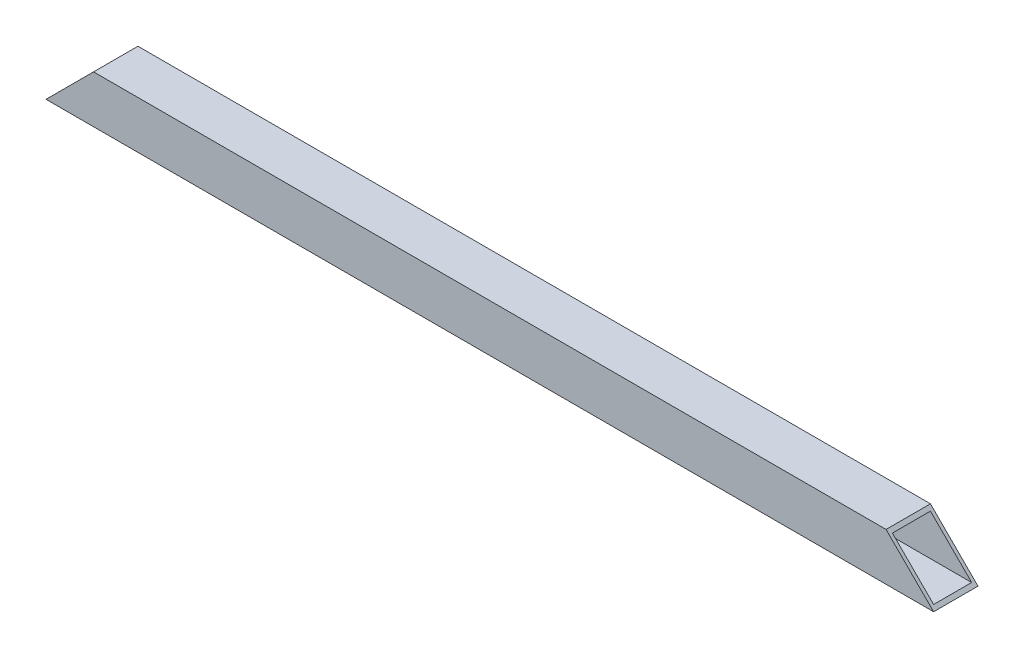
ISO-10303-21;
HEADER;
FILE_DESCRIPTION(('STEP AP214'),'2;1');
FILE_NAME('part.step','',(''),(''),'','','');
FILE_SCHEMA(('AUTOMOTIVE_DESIGN { 1 0 10303 214 1 1 1 1 }'));
ENDSEC;
DATA;
#1=APPLICATION_CONTEXT('core data for automotive mechanical design processes');
#2=APPLICATION_PROTOCOL_DEFINITION('international standard','automotive_design',2000,#1);
#3=PRODUCT_CONTEXT('',#1,'mechanical');
#4=PRODUCT('Part','Part','',(#3));
#5=PRODUCT_RELATED_PRODUCT_CATEGORY('part','',(#4));
#6=PRODUCT_DEFINITION_FORMATION('','',#4);
#7=PRODUCT_DEFINITION_CONTEXT('part definition',#1,'design');
#8=PRODUCT_DEFINITION('design','',#6,#7);
#9=PRODUCT_DEFINITION_SHAPE('','',#8);
#10=(LENGTH_UNIT() NAMED_UNIT(*) SI_UNIT(.MILLI.,.METRE.));
#11=(NAMED_UNIT(*) PLANE_ANGLE_UNIT() SI_UNIT($,.RADIAN.));
#12=(NAMED_UNIT(*) SI_UNIT($,.STERADIAN.) SOLID_ANGLE_UNIT());
#13=UNCERTAINTY_MEASURE_WITH_UNIT(LENGTH_MEASURE(1.E-05),#10,'distance_accuracy_value','');
#14=(GEOMETRIC_REPRESENTATION_CONTEXT(3) GLOBAL_UNCERTAINTY_ASSIGNED_CONTEXT((#13)) GLOBAL_UNIT_ASSIGNED_CONTEXT((#10,
#11,#12)) REPRESENTATION_CONTEXT('',''));
#15=CARTESIAN_POINT('',(0.,0.,0.));
#16=DIRECTION('',(0.,0.,1.));
#17=DIRECTION('',(1.,0.,0.));
#18=AXIS2_PLACEMENT_3D('',#15,#16,#17);
#19=CARTESIAN_POINT('',(1400.,-32.5,35.));
#20=DIRECTION('',(0.,1.,0.));
#21=DIRECTION('',(0.,0.,1.));
#22=AXIS2_PLACEMENT_3D('',#19,#20,#21);
#23=PLANE('',#22);
#24=DIRECTION('',(-1.,0.,0.));
#25=VECTOR('',#24,1.);
#26=CARTESIAN_POINT('',(1400.,-32.5,30.));
#27=LINE('',#26,#25);
#28=CARTESIAN_POINT('',(1395.,-32.5,30.));
#29=VERTEX_POINT('',#28);
#30=CARTESIAN_POINT('',(5.00000000000012,-32.5,30.));
#31=VERTEX_POINT('',#30);
#32=EDGE_CURVE('E160',#29,#31,#27,.T.);
#33=ORIENTED_EDGE('',*,*,#32,.F.);
#34=DIRECTION('',(0.,0.,-1.));
#35=VECTOR('',#34,1.);
#36=CARTESIAN_POINT('',(1395.,-32.5,35.));
#37=LINE('',#36,#35);
#38=CARTESIAN_POINT('',(1395.,-32.5,-30.));
#39=VERTEX_POINT('',#38);
#40=EDGE_CURVE('E13',#29,#39,#37,.T.);
#41=ORIENTED_EDGE('',*,*,#40,.T.);
#42=DIRECTION('',(-1.,0.,0.));
#43=VECTOR('',#42,1.);
#44=CARTESIAN_POINT('',(1400.,-32.5,-30.));
#45=LINE('',#44,#43);
#46=CARTESIAN_POINT('',(5.0000000000001,-32.5,-30.));
#47=VERTEX_POINT('',#46);
#48=EDGE_CURVE('E162',#39,#47,#45,.T.);
#49=ORIENTED_EDGE('',*,*,#48,.T.);
#50=DIRECTION('',(0.,0.,1.));
#51=VECTOR('',#50,1.);
#52=CARTESIAN_POINT('',(5.00000000000012,-32.5,35.0000000000004));
#53=LINE('',#52,#51);
#54=EDGE_CURVE('E67',#47,#31,#53,.T.);
#55=ORIENTED_EDGE('',*,*,#54,.T.);
#56=EDGE_LOOP('',(#33,#41,#49,#55));
#57=FACE_BOUND('',#56,.T.);
#58=ADVANCED_FACE('F59',(#57),#23,.T.);
#59=CARTESIAN_POINT('',(1400.,37.5,30.));
#60=DIRECTION('',(0.,0.,-1.));
#61=DIRECTION('',(0.,1.,0.));
#62=AXIS2_PLACEMENT_3D('',#59,#60,#61);
#63=PLANE('',#62);
#64=DIRECTION('',(-1.,0.,0.));
#65=VECTOR('',#64,1.);
#66=CARTESIAN_POINT('',(1400.,32.5,30.));
#67=LINE('',#66,#65);
#68=CARTESIAN_POINT('',(1330.,32.5,30.));
#69=VERTEX_POINT('',#68);
#70=CARTESIAN_POINT('',(69.9999999999998,32.5,30.));
#71=VERTEX_POINT('',#70);
#72=EDGE_CURVE('E170',#69,#71,#67,.T.);
#73=ORIENTED_EDGE('',*,*,#72,.F.);
#74=DIRECTION('',(0.707106781186546,-0.707106781186549,0.));
#75=VECTOR('',#74,1.);
#76=CARTESIAN_POINT('',(1362.5,3.53883589099269E-13,30.));
#77=LINE('',#76,#75);
#78=EDGE_CURVE('E169',#69,#29,#77,.T.);
#79=ORIENTED_EDGE('',*,*,#78,.T.);
#80=ORIENTED_EDGE('',*,*,#32,.T.);
#81=DIRECTION('',(0.707106781186546,0.707106781186549,0.));
#82=VECTOR('',#81,1.);
#83=CARTESIAN_POINT('',(737.499999999997,700.,30.0000000000001));
#84=LINE('',#83,#82);
#85=EDGE_CURVE('E81',#31,#71,#84,.T.);
#86=ORIENTED_EDGE('',*,*,#85,.T.);
#87=EDGE_LOOP('',(#73,#79,#80,#86));
#88=FACE_BOUND('',#87,.T.);
#89=ADVANCED_FACE('F167',(#88),#63,.T.);
#90=CARTESIAN_POINT('',(1400.,32.5,35.));
#91=DIRECTION('',(0.,-1.,0.));
#92=DIRECTION('',(0.,0.,-1.));
#93=AXIS2_PLACEMENT_3D('',#90,#91,#92);
#94=PLANE('',#93);
#95=DIRECTION('',(-1.,0.,0.));
#96=VECTOR('',#95,1.);
#97=CARTESIAN_POINT('',(1400.,32.5,-30.));
#98=LINE('',#97,#96);
#99=CARTESIAN_POINT('',(1330.,32.5,-30.));
#100=VERTEX_POINT('',#99);
#101=CARTESIAN_POINT('',(69.9999999999996,32.5,-30.));
#102=VERTEX_POINT('',#101);
#103=EDGE_CURVE('E134',#100,#102,#98,.T.);
#104=ORIENTED_EDGE('',*,*,#103,.F.);
#105=DIRECTION('',(0.,0.,1.));
#106=VECTOR('',#105,1.);
#107=CARTESIAN_POINT('',(1330.,32.5,35.));
#108=LINE('',#107,#106);
#109=EDGE_CURVE('E199',#100,#69,#108,.T.);
#110=ORIENTED_EDGE('',*,*,#109,.T.);
#111=ORIENTED_EDGE('',*,*,#72,.T.);
#112=DIRECTION('',(0.,0.,-1.));
#113=VECTOR('',#112,1.);
#114=CARTESIAN_POINT('',(69.9999999999996,32.5,35.0000000000004));
#115=LINE('',#114,#113);
#116=EDGE_CURVE('E193',#71,#102,#115,.T.);
#117=ORIENTED_EDGE('',*,*,#116,.T.);
#118=EDGE_LOOP('',(#104,#110,#111,#117));
#119=FACE_BOUND('',#118,.T.);
#120=ADVANCED_FACE('F205',(#119),#94,.T.);
#121=CARTESIAN_POINT('',(1400.,37.5,-30.));
#122=DIRECTION('',(0.,0.,1.));
#123=DIRECTION('',(0.,-1.,0.));
#124=AXIS2_PLACEMENT_3D('',#121,#122,#123);
#125=PLANE('',#124);
#126=ORIENTED_EDGE('',*,*,#48,.F.);
#127=DIRECTION('',(-0.707106781186546,0.707106781186549,0.));
#128=VECTOR('',#127,1.);
#129=CARTESIAN_POINT('',(1362.5,3.60822483003176E-13,-30.));
#130=LINE('',#129,#128);
#131=EDGE_CURVE('E74',#39,#100,#130,.T.);
#132=ORIENTED_EDGE('',*,*,#131,.T.);
#133=ORIENTED_EDGE('',*,*,#103,.T.);
#134=DIRECTION('',(-0.707106781186546,-0.707106781186549,0.));
#135=VECTOR('',#134,1.);
#136=CARTESIAN_POINT('',(737.499999999997,700.,-29.9999999999998));
#137=LINE('',#136,#135);
#138=EDGE_CURVE('E196',#102,#47,#137,.T.);
#139=ORIENTED_EDGE('',*,*,#138,.T.);
#140=EDGE_LOOP('',(#126,#132,#133,#139));
#141=FACE_BOUND('',#140,.T.);
#142=ADVANCED_FACE('F203',(#141),#125,.T.);
#143=CARTESIAN_POINT('',(74.9999999999997,37.5,35.));
#144=DIRECTION('',(-0.707106781186549,0.707106781186546,0.));
#145=DIRECTION('',(-0.707106781186546,-0.707106781186549,0.));
#146=AXIS2_PLACEMENT_3D('',#143,#144,#145);
#147=PLANE('',#146);
#148=ORIENTED_EDGE('',*,*,#116,.F.);
#149=ORIENTED_EDGE('',*,*,#85,.F.);
#150=ORIENTED_EDGE('',*,*,#54,.F.);
#151=ORIENTED_EDGE('',*,*,#138,.F.);
#152=EDGE_LOOP('',(#148,#149,#150,#151));
#153=FACE_BOUND('',#152,.T.);
#154=DIRECTION('',(0.707106781186546,0.707106781186549,0.));
#155=VECTOR('',#154,1.);
#156=CARTESIAN_POINT('',(74.9999999999997,37.5,-35.));
#157=LINE('',#156,#155);
#158=CARTESIAN_POINT('',(0.,-37.5,-35.));
#159=VERTEX_POINT('',#158);
#160=CARTESIAN_POINT('',(74.9999999999997,37.5,-35.));
#161=VERTEX_POINT('',#160);
#162=EDGE_CURVE('E128',#159,#161,#157,.T.);
#163=ORIENTED_EDGE('',*,*,#162,.F.);
#164=DIRECTION('',(0.,0.,-1.));
#165=VECTOR('',#164,1.);
#166=CARTESIAN_POINT('',(0.,-37.5,35.));
#167=LINE('',#166,#165);
#168=CARTESIAN_POINT('',(0.,-37.5,35.));
#169=VERTEX_POINT('',#168);
#170=EDGE_CURVE('E122',#169,#159,#167,.T.);
#171=ORIENTED_EDGE('',*,*,#170,.F.);
#172=DIRECTION('',(0.707106781186546,0.707106781186549,0.));
#173=VECTOR('',#172,1.);
#174=CARTESIAN_POINT('',(74.9999999999997,37.5,35.));
#175=LINE('',#174,#173);
#176=CARTESIAN_POINT('',(74.9999999999997,37.5,35.));
#177=VERTEX_POINT('',#176);
#178=EDGE_CURVE('E125',#169,#177,#175,.T.);
#179=ORIENTED_EDGE('',*,*,#178,.T.);
#180=DIRECTION('',(0.,0.,-1.));
#181=VECTOR('',#180,1.);
#182=CARTESIAN_POINT('',(74.9999999999997,37.5,35.));
#183=LINE('',#182,#181);
#184=EDGE_CURVE('E190',#177,#161,#183,.T.);
#185=ORIENTED_EDGE('',*,*,#184,.T.);
#186=EDGE_LOOP('',(#163,#171,#179,#185));
#187=FACE_BOUND('',#186,.T.);
#188=ADVANCED_FACE('F124',(#153,#187),#147,.T.);
#189=CARTESIAN_POINT('',(1400.,-37.5,35.));
#190=DIRECTION('',(0.707106781186549,0.707106781186546,0.));
#191=DIRECTION('',(-0.707106781186546,0.707106781186549,0.));
#192=AXIS2_PLACEMENT_3D('',#189,#190,#191);
#193=PLANE('',#192);
#194=ORIENTED_EDGE('',*,*,#40,.F.);
#195=ORIENTED_EDGE('',*,*,#78,.F.);
#196=ORIENTED_EDGE('',*,*,#109,.F.);
#197=ORIENTED_EDGE('',*,*,#131,.F.);
#198=EDGE_LOOP('',(#194,#195,#196,#197));
#199=FACE_BOUND('',#198,.T.);
#200=DIRECTION('',(0.707106781186546,-0.707106781186549,0.));
#201=VECTOR('',#200,1.);
#202=CARTESIAN_POINT('',(1400.,-37.5,-35.));
#203=LINE('',#202,#201);
#204=CARTESIAN_POINT('',(1325.,37.5,-35.));
#205=VERTEX_POINT('',#204);
#206=CARTESIAN_POINT('',(1400.,-37.5,-35.));
#207=VERTEX_POINT('',#206);
#208=EDGE_CURVE('E146',#205,#207,#203,.T.);
#209=ORIENTED_EDGE('',*,*,#208,.F.);
#210=DIRECTION('',(0.,0.,-1.));
#211=VECTOR('',#210,1.);
#212=CARTESIAN_POINT('',(1325.,37.5,35.));
#213=LINE('',#212,#211);
#214=CARTESIAN_POINT('',(1325.,37.5,35.));
#215=VERTEX_POINT('',#214);
#216=EDGE_CURVE('E188',#215,#205,#213,.T.);
#217=ORIENTED_EDGE('',*,*,#216,.F.);
#218=DIRECTION('',(0.707106781186546,-0.707106781186549,0.));
#219=VECTOR('',#218,1.);
#220=CARTESIAN_POINT('',(1400.,-37.5,35.));
#221=LINE('',#220,#219);
#222=CARTESIAN_POINT('',(1400.,-37.5,35.));
#223=VERTEX_POINT('',#222);
#224=EDGE_CURVE('E145',#215,#223,#221,.T.);
#225=ORIENTED_EDGE('',*,*,#224,.T.);
#226=DIRECTION('',(0.,0.,-1.));
#227=VECTOR('',#226,1.);
#228=CARTESIAN_POINT('',(1400.,-37.5,35.));
#229=LINE('',#228,#227);
#230=EDGE_CURVE('E133',#223,#207,#229,.T.);
#231=ORIENTED_EDGE('',*,*,#230,.T.);
#232=EDGE_LOOP('',(#209,#217,#225,#231));
#233=FACE_BOUND('',#232,.T.);
#234=ADVANCED_FACE('F180',(#199,#233),#193,.T.);
#235=CARTESIAN_POINT('',(1400.,37.5,-35.));
#236=DIRECTION('',(0.,0.,1.));
#237=DIRECTION('',(0.,-1.,0.));
#238=AXIS2_PLACEMENT_3D('',#235,#236,#237);
#239=PLANE('',#238);
#240=ORIENTED_EDGE('',*,*,#208,.T.);
#241=DIRECTION('',(-1.,0.,0.));
#242=VECTOR('',#241,1.);
#243=CARTESIAN_POINT('',(1400.,-37.5,-35.));
#244=LINE('',#243,#242);
#245=EDGE_CURVE('E149',#207,#159,#244,.T.);
#246=ORIENTED_EDGE('',*,*,#245,.T.);
#247=ORIENTED_EDGE('',*,*,#162,.T.);
#248=DIRECTION('',(-1.,0.,0.));
#249=VECTOR('',#248,1.);
#250=CARTESIAN_POINT('',(1400.,37.5,-35.));
#251=LINE('',#250,#249);
#252=EDGE_CURVE('E151',#205,#161,#251,.T.);
#253=ORIENTED_EDGE('',*,*,#252,.F.);
#254=EDGE_LOOP('',(#240,#246,#247,#253));
#255=FACE_BOUND('',#254,.T.);
#256=ADVANCED_FACE('F61',(#255),#239,.F.);
#257=CARTESIAN_POINT('',(1400.,37.5,35.));
#258=DIRECTION('',(0.,-1.,0.));
#259=DIRECTION('',(0.,0.,-1.));
#260=AXIS2_PLACEMENT_3D('',#257,#258,#259);
#261=PLANE('',#260);
#262=ORIENTED_EDGE('',*,*,#216,.T.);
#263=ORIENTED_EDGE('',*,*,#252,.T.);
#264=ORIENTED_EDGE('',*,*,#184,.F.);
#265=DIRECTION('',(-1.,0.,0.));
#266=VECTOR('',#265,1.);
#267=CARTESIAN_POINT('',(1400.,37.5,35.));
#268=LINE('',#267,#266);
#269=EDGE_CURVE('E144',#215,#177,#268,.T.);
#270=ORIENTED_EDGE('',*,*,#269,.F.);
#271=EDGE_LOOP('',(#262,#263,#264,#270));
#272=FACE_BOUND('',#271,.T.);
#273=ADVANCED_FACE('F226',(#272),#261,.F.);
#274=CARTESIAN_POINT('',(1400.,37.5,35.));
#275=DIRECTION('',(0.,0.,-1.));
#276=DIRECTION('',(0.,1.,0.));
#277=AXIS2_PLACEMENT_3D('',#274,#275,#276);
#278=PLANE('',#277);
#279=ORIENTED_EDGE('',*,*,#224,.F.);
#280=ORIENTED_EDGE('',*,*,#269,.T.);
#281=ORIENTED_EDGE('',*,*,#178,.F.);
#282=DIRECTION('',(-1.,0.,0.));
#283=VECTOR('',#282,1.);
#284=CARTESIAN_POINT('',(1400.,-37.5,35.));
#285=LINE('',#284,#283);
#286=EDGE_CURVE('E141',#223,#169,#285,.T.);
#287=ORIENTED_EDGE('',*,*,#286,.F.);
#288=EDGE_LOOP('',(#279,#280,#281,#287));
#289=FACE_BOUND('',#288,.T.);
#290=ADVANCED_FACE('F140',(#289),#278,.F.);
#291=CARTESIAN_POINT('',(1400.,-37.5,35.));
#292=DIRECTION('',(0.,1.,0.));
#293=DIRECTION('',(0.,0.,1.));
#294=AXIS2_PLACEMENT_3D('',#291,#292,#293);
#295=PLANE('',#294);
#296=ORIENTED_EDGE('',*,*,#170,.T.);
#297=ORIENTED_EDGE('',*,*,#245,.F.);
#298=ORIENTED_EDGE('',*,*,#230,.F.);
#299=ORIENTED_EDGE('',*,*,#286,.T.);
#300=EDGE_LOOP('',(#296,#297,#298,#299));
#301=FACE_BOUND('',#300,.T.);
#302=ADVANCED_FACE('F148',(#301),#295,.F.);
#303=CLOSED_SHELL('',(#58,#89,#120,#142,#188,#234,#256,#273,#290,#302));
#304=MANIFOLD_SOLID_BREP('B2',#303);
#305=ADVANCED_BREP_SHAPE_REPRESENTATION('',(#18,#304),#14);
#306=SHAPE_DEFINITION_REPRESENTATION(#9,#305);
ENDSEC;
END-ISO-10303-21;
